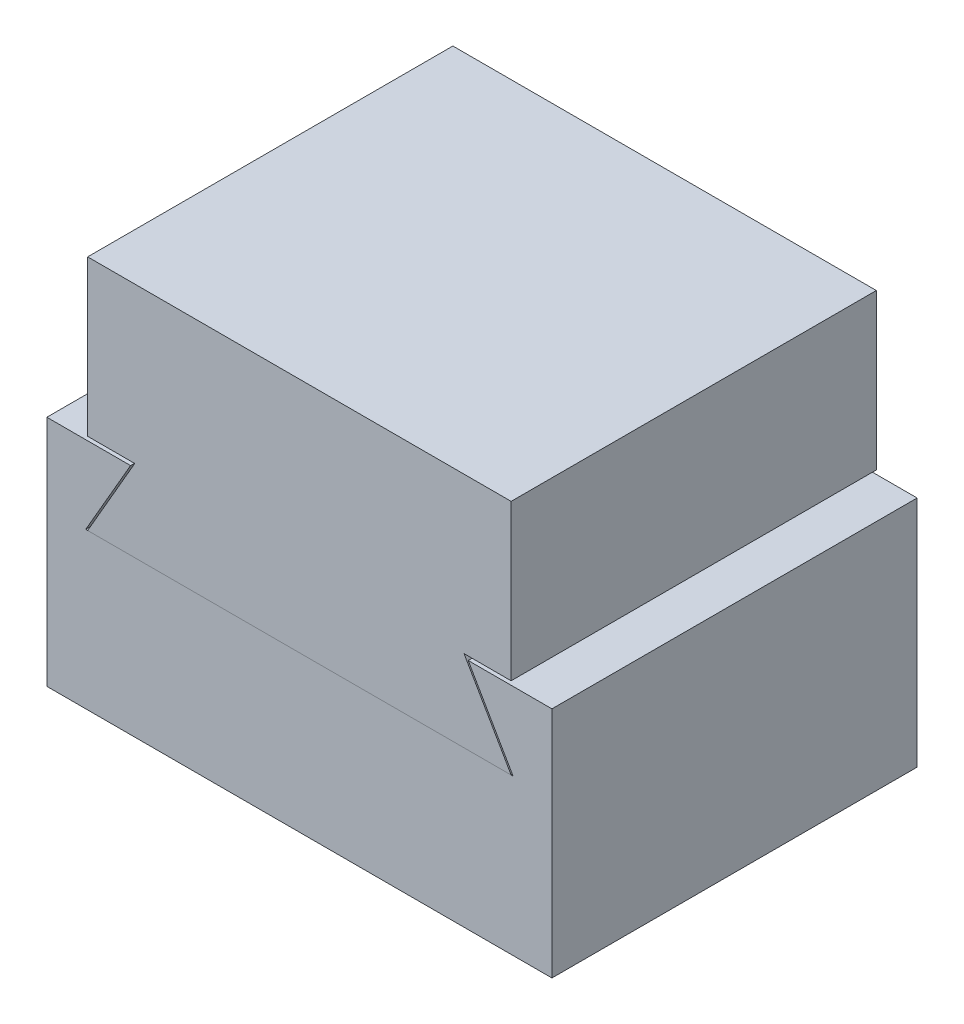
ISO-10303-21;
HEADER;
FILE_DESCRIPTION(('STEP AP214'),'2;1');
FILE_NAME('part.step','',(''),(''),'','','');
FILE_SCHEMA(('AUTOMOTIVE_DESIGN { 1 0 10303 214 1 1 1 1 }'));
ENDSEC;
DATA;
#1=APPLICATION_CONTEXT('core data for automotive mechanical design processes');
#2=APPLICATION_PROTOCOL_DEFINITION('international standard','automotive_design',2000,#1);
#3=PRODUCT_CONTEXT('',#1,'mechanical');
#4=PRODUCT('Part','Part','',(#3));
#5=PRODUCT_RELATED_PRODUCT_CATEGORY('part','',(#4));
#6=PRODUCT_DEFINITION_FORMATION('','',#4);
#7=PRODUCT_DEFINITION_CONTEXT('part definition',#1,'design');
#8=PRODUCT_DEFINITION('design','',#6,#7);
#9=PRODUCT_DEFINITION_SHAPE('','',#8);
#10=(LENGTH_UNIT() NAMED_UNIT(*) SI_UNIT(.MILLI.,.METRE.));
#11=(NAMED_UNIT(*) PLANE_ANGLE_UNIT() SI_UNIT($,.RADIAN.));
#12=(NAMED_UNIT(*) SI_UNIT($,.STERADIAN.) SOLID_ANGLE_UNIT());
#13=UNCERTAINTY_MEASURE_WITH_UNIT(LENGTH_MEASURE(1.E-05),#10,'distance_accuracy_value','');
#14=(GEOMETRIC_REPRESENTATION_CONTEXT(3) GLOBAL_UNCERTAINTY_ASSIGNED_CONTEXT((#13)) GLOBAL_UNIT_ASSIGNED_CONTEXT((#10,
#11,#12)) REPRESENTATION_CONTEXT('',''));
#15=CARTESIAN_POINT('',(0.,0.,0.));
#16=DIRECTION('',(0.,0.,1.));
#17=DIRECTION('',(1.,0.,0.));
#18=AXIS2_PLACEMENT_3D('',#15,#16,#17);
#19=CARTESIAN_POINT('',(-6.985,0.,11.938));
#20=DIRECTION('',(-0.866025403784439,0.5,0.));
#21=DIRECTION('',(-0.5,-0.866025403784439,0.));
#22=AXIS2_PLACEMENT_3D('',#19,#20,#21);
#23=PLANE('',#22);
#24=DIRECTION('',(0.5,0.866025403784439,0.));
#25=VECTOR('',#24,1.);
#26=CARTESIAN_POINT('',(-6.985,0.,0.));
#27=LINE('',#26,#25);
#28=CARTESIAN_POINT('',(-6.985,0.,0.));
#29=VERTEX_POINT('',#28);
#30=CARTESIAN_POINT('',(-5.51853031625835,2.54,0.));
#31=VERTEX_POINT('',#30);
#32=EDGE_CURVE('E142',#29,#31,#27,.T.);
#33=ORIENTED_EDGE('',*,*,#32,.T.);
#34=DIRECTION('',(0.,0.,-1.));
#35=VECTOR('',#34,1.);
#36=CARTESIAN_POINT('',(-5.51853031625835,2.54,11.938));
#37=LINE('',#36,#35);
#38=CARTESIAN_POINT('',(-5.51853031625835,2.54,11.938));
#39=VERTEX_POINT('',#38);
#40=EDGE_CURVE('E12',#39,#31,#37,.T.);
#41=ORIENTED_EDGE('',*,*,#40,.F.);
#42=DIRECTION('',(0.5,0.866025403784439,0.));
#43=VECTOR('',#42,1.);
#44=CARTESIAN_POINT('',(-6.985,0.,11.938));
#45=LINE('',#44,#43);
#46=CARTESIAN_POINT('',(-6.985,0.,11.938));
#47=VERTEX_POINT('',#46);
#48=EDGE_CURVE('E156',#47,#39,#45,.T.);
#49=ORIENTED_EDGE('',*,*,#48,.F.);
#50=DIRECTION('',(0.,0.,-1.));
#51=VECTOR('',#50,1.);
#52=CARTESIAN_POINT('',(-6.985,0.,11.938));
#53=LINE('',#52,#51);
#54=EDGE_CURVE('E138',#47,#29,#53,.T.);
#55=ORIENTED_EDGE('',*,*,#54,.T.);
#56=EDGE_LOOP('',(#33,#41,#49,#55));
#57=FACE_BOUND('',#56,.T.);
#58=ADVANCED_FACE('F46',(#57),#23,.F.);
#59=CARTESIAN_POINT('',(-8.255,2.54,11.938));
#60=DIRECTION('',(0.,-1.,0.));
#61=DIRECTION('',(0.,0.,-1.));
#62=AXIS2_PLACEMENT_3D('',#59,#60,#61);
#63=PLANE('',#62);
#64=DIRECTION('',(-1.,0.,0.));
#65=VECTOR('',#64,1.);
#66=CARTESIAN_POINT('',(-8.255,2.54,0.));
#67=LINE('',#66,#65);
#68=CARTESIAN_POINT('',(-8.255,2.54,0.));
#69=VERTEX_POINT('',#68);
#70=EDGE_CURVE('E145',#31,#69,#67,.T.);
#71=ORIENTED_EDGE('',*,*,#70,.T.);
#72=DIRECTION('',(0.,0.,-1.));
#73=VECTOR('',#72,1.);
#74=CARTESIAN_POINT('',(-8.255,2.54,11.938));
#75=LINE('',#74,#73);
#76=CARTESIAN_POINT('',(-8.255,2.54,11.938));
#77=VERTEX_POINT('',#76);
#78=EDGE_CURVE('E54',#77,#69,#75,.T.);
#79=ORIENTED_EDGE('',*,*,#78,.F.);
#80=DIRECTION('',(-1.,0.,0.));
#81=VECTOR('',#80,1.);
#82=CARTESIAN_POINT('',(-8.255,2.54,11.938));
#83=LINE('',#82,#81);
#84=EDGE_CURVE('E105',#39,#77,#83,.T.);
#85=ORIENTED_EDGE('',*,*,#84,.F.);
#86=ORIENTED_EDGE('',*,*,#40,.T.);
#87=EDGE_LOOP('',(#71,#79,#85,#86));
#88=FACE_BOUND('',#87,.T.);
#89=ADVANCED_FACE('F191',(#88),#63,.F.);
#90=CARTESIAN_POINT('',(-8.255,-5.08,11.938));
#91=DIRECTION('',(1.,0.,0.));
#92=DIRECTION('',(0.,0.,-1.));
#93=AXIS2_PLACEMENT_3D('',#90,#91,#92);
#94=PLANE('',#93);
#95=DIRECTION('',(0.,-1.,0.));
#96=VECTOR('',#95,1.);
#97=CARTESIAN_POINT('',(-8.255,-5.08,0.));
#98=LINE('',#97,#96);
#99=CARTESIAN_POINT('',(-8.255,-5.08,0.));
#100=VERTEX_POINT('',#99);
#101=EDGE_CURVE('E147',#69,#100,#98,.T.);
#102=ORIENTED_EDGE('',*,*,#101,.T.);
#103=DIRECTION('',(0.,0.,-1.));
#104=VECTOR('',#103,1.);
#105=CARTESIAN_POINT('',(-8.255,-5.08,11.938));
#106=LINE('',#105,#104);
#107=CARTESIAN_POINT('',(-8.255,-5.08,11.938));
#108=VERTEX_POINT('',#107);
#109=EDGE_CURVE('E163',#108,#100,#106,.T.);
#110=ORIENTED_EDGE('',*,*,#109,.F.);
#111=DIRECTION('',(0.,-1.,0.));
#112=VECTOR('',#111,1.);
#113=CARTESIAN_POINT('',(-8.255,-5.08,11.938));
#114=LINE('',#113,#112);
#115=EDGE_CURVE('E171',#77,#108,#114,.T.);
#116=ORIENTED_EDGE('',*,*,#115,.F.);
#117=ORIENTED_EDGE('',*,*,#78,.T.);
#118=EDGE_LOOP('',(#102,#110,#116,#117));
#119=FACE_BOUND('',#118,.T.);
#120=ADVANCED_FACE('F169',(#119),#94,.F.);
#121=CARTESIAN_POINT('',(8.255,-5.08,11.938));
#122=DIRECTION('',(0.,1.,0.));
#123=DIRECTION('',(-1.,0.,0.));
#124=AXIS2_PLACEMENT_3D('',#121,#122,#123);
#125=PLANE('',#124);
#126=DIRECTION('',(1.,0.,0.));
#127=VECTOR('',#126,1.);
#128=CARTESIAN_POINT('',(8.255,-5.08,0.));
#129=LINE('',#128,#127);
#130=CARTESIAN_POINT('',(8.255,-5.08,0.));
#131=VERTEX_POINT('',#130);
#132=EDGE_CURVE('E149',#100,#131,#129,.T.);
#133=ORIENTED_EDGE('',*,*,#132,.T.);
#134=DIRECTION('',(0.,0.,-1.));
#135=VECTOR('',#134,1.);
#136=CARTESIAN_POINT('',(8.255,-5.08,11.938));
#137=LINE('',#136,#135);
#138=CARTESIAN_POINT('',(8.255,-5.08,11.938));
#139=VERTEX_POINT('',#138);
#140=EDGE_CURVE('E160',#139,#131,#137,.T.);
#141=ORIENTED_EDGE('',*,*,#140,.F.);
#142=DIRECTION('',(1.,0.,0.));
#143=VECTOR('',#142,1.);
#144=CARTESIAN_POINT('',(8.255,-5.08,11.938));
#145=LINE('',#144,#143);
#146=EDGE_CURVE('E183',#108,#139,#145,.T.);
#147=ORIENTED_EDGE('',*,*,#146,.F.);
#148=ORIENTED_EDGE('',*,*,#109,.T.);
#149=EDGE_LOOP('',(#133,#141,#147,#148));
#150=FACE_BOUND('',#149,.T.);
#151=ADVANCED_FACE('F179',(#150),#125,.F.);
#152=CARTESIAN_POINT('',(8.255,2.54,11.938));
#153=DIRECTION('',(-1.,0.,0.));
#154=DIRECTION('',(0.,0.,1.));
#155=AXIS2_PLACEMENT_3D('',#152,#153,#154);
#156=PLANE('',#155);
#157=DIRECTION('',(0.,1.,0.));
#158=VECTOR('',#157,1.);
#159=CARTESIAN_POINT('',(8.255,2.54,0.));
#160=LINE('',#159,#158);
#161=CARTESIAN_POINT('',(8.255,2.54,0.));
#162=VERTEX_POINT('',#161);
#163=EDGE_CURVE('E151',#131,#162,#160,.T.);
#164=ORIENTED_EDGE('',*,*,#163,.T.);
#165=DIRECTION('',(0.,0.,-1.));
#166=VECTOR('',#165,1.);
#167=CARTESIAN_POINT('',(8.255,2.54,11.938));
#168=LINE('',#167,#166);
#169=CARTESIAN_POINT('',(8.255,2.54,11.938));
#170=VERTEX_POINT('',#169);
#171=EDGE_CURVE('E133',#170,#162,#168,.T.);
#172=ORIENTED_EDGE('',*,*,#171,.F.);
#173=DIRECTION('',(0.,1.,0.));
#174=VECTOR('',#173,1.);
#175=CARTESIAN_POINT('',(8.255,2.54,11.938));
#176=LINE('',#175,#174);
#177=EDGE_CURVE('E124',#139,#170,#176,.T.);
#178=ORIENTED_EDGE('',*,*,#177,.F.);
#179=ORIENTED_EDGE('',*,*,#140,.T.);
#180=EDGE_LOOP('',(#164,#172,#178,#179));
#181=FACE_BOUND('',#180,.T.);
#182=ADVANCED_FACE('F182',(#181),#156,.F.);
#183=CARTESIAN_POINT('',(5.51853031625835,2.54,11.938));
#184=DIRECTION('',(0.,-1.,0.));
#185=DIRECTION('',(0.,0.,-1.));
#186=AXIS2_PLACEMENT_3D('',#183,#184,#185);
#187=PLANE('',#186);
#188=DIRECTION('',(-1.,0.,0.));
#189=VECTOR('',#188,1.);
#190=CARTESIAN_POINT('',(5.51853031625835,2.54,0.));
#191=LINE('',#190,#189);
#192=CARTESIAN_POINT('',(5.51853031625835,2.54,0.));
#193=VERTEX_POINT('',#192);
#194=EDGE_CURVE('E132',#162,#193,#191,.T.);
#195=ORIENTED_EDGE('',*,*,#194,.T.);
#196=DIRECTION('',(0.,0.,-1.));
#197=VECTOR('',#196,1.);
#198=CARTESIAN_POINT('',(5.51853031625835,2.54,11.938));
#199=LINE('',#198,#197);
#200=CARTESIAN_POINT('',(5.51853031625835,2.54,11.938));
#201=VERTEX_POINT('',#200);
#202=EDGE_CURVE('E129',#201,#193,#199,.T.);
#203=ORIENTED_EDGE('',*,*,#202,.F.);
#204=DIRECTION('',(-1.,0.,0.));
#205=VECTOR('',#204,1.);
#206=CARTESIAN_POINT('',(5.51853031625835,2.54,11.938));
#207=LINE('',#206,#205);
#208=EDGE_CURVE('E118',#170,#201,#207,.T.);
#209=ORIENTED_EDGE('',*,*,#208,.F.);
#210=ORIENTED_EDGE('',*,*,#171,.T.);
#211=EDGE_LOOP('',(#195,#203,#209,#210));
#212=FACE_BOUND('',#211,.T.);
#213=ADVANCED_FACE('F130',(#212),#187,.F.);
#214=CARTESIAN_POINT('',(6.985,0.,11.938));
#215=DIRECTION('',(0.866025403784439,0.5,0.));
#216=DIRECTION('',(-0.5,0.866025403784438,0.));
#217=AXIS2_PLACEMENT_3D('',#214,#215,#216);
#218=PLANE('',#217);
#219=DIRECTION('',(0.5,-0.866025403784439,0.));
#220=VECTOR('',#219,1.);
#221=CARTESIAN_POINT('',(6.985,0.,0.));
#222=LINE('',#221,#220);
#223=CARTESIAN_POINT('',(6.985,0.,0.));
#224=VERTEX_POINT('',#223);
#225=EDGE_CURVE('E91',#193,#224,#222,.T.);
#226=ORIENTED_EDGE('',*,*,#225,.T.);
#227=DIRECTION('',(0.,0.,-1.));
#228=VECTOR('',#227,1.);
#229=CARTESIAN_POINT('',(6.985,0.,11.938));
#230=LINE('',#229,#228);
#231=CARTESIAN_POINT('',(6.985,0.,11.938));
#232=VERTEX_POINT('',#231);
#233=EDGE_CURVE('E134',#232,#224,#230,.T.);
#234=ORIENTED_EDGE('',*,*,#233,.F.);
#235=DIRECTION('',(0.5,-0.866025403784439,0.));
#236=VECTOR('',#235,1.);
#237=CARTESIAN_POINT('',(6.985,0.,11.938));
#238=LINE('',#237,#236);
#239=EDGE_CURVE('E122',#201,#232,#238,.T.);
#240=ORIENTED_EDGE('',*,*,#239,.F.);
#241=ORIENTED_EDGE('',*,*,#202,.T.);
#242=EDGE_LOOP('',(#226,#234,#240,#241));
#243=FACE_BOUND('',#242,.T.);
#244=ADVANCED_FACE('F136',(#243),#218,.F.);
#245=CARTESIAN_POINT('',(-6.985,0.,11.938));
#246=DIRECTION('',(0.,-1.,0.));
#247=DIRECTION('',(0.,0.,-1.));
#248=AXIS2_PLACEMENT_3D('',#245,#246,#247);
#249=PLANE('',#248);
#250=DIRECTION('',(-1.,0.,0.));
#251=VECTOR('',#250,1.);
#252=CARTESIAN_POINT('',(-6.985,0.,0.));
#253=LINE('',#252,#251);
#254=EDGE_CURVE('E97',#224,#29,#253,.T.);
#255=ORIENTED_EDGE('',*,*,#254,.T.);
#256=ORIENTED_EDGE('',*,*,#54,.F.);
#257=DIRECTION('',(-1.,0.,0.));
#258=VECTOR('',#257,1.);
#259=CARTESIAN_POINT('',(-6.985,0.,11.938));
#260=LINE('',#259,#258);
#261=EDGE_CURVE('E62',#232,#47,#260,.T.);
#262=ORIENTED_EDGE('',*,*,#261,.F.);
#263=ORIENTED_EDGE('',*,*,#233,.T.);
#264=EDGE_LOOP('',(#255,#256,#262,#263));
#265=FACE_BOUND('',#264,.T.);
#266=ADVANCED_FACE('F207',(#265),#249,.F.);
#267=CARTESIAN_POINT('',(-5.51853031625835,2.54,11.938));
#268=DIRECTION('',(0.,0.,-1.));
#269=DIRECTION('',(-1.,0.,0.));
#270=AXIS2_PLACEMENT_3D('',#267,#268,#269);
#271=PLANE('',#270);
#272=ORIENTED_EDGE('',*,*,#48,.T.);
#273=ORIENTED_EDGE('',*,*,#84,.T.);
#274=ORIENTED_EDGE('',*,*,#115,.T.);
#275=ORIENTED_EDGE('',*,*,#146,.T.);
#276=ORIENTED_EDGE('',*,*,#177,.T.);
#277=ORIENTED_EDGE('',*,*,#208,.T.);
#278=ORIENTED_EDGE('',*,*,#239,.T.);
#279=ORIENTED_EDGE('',*,*,#261,.T.);
#280=EDGE_LOOP('',(#272,#273,#274,#275,#276,#277,#278,#279));
#281=FACE_BOUND('',#280,.T.);
#282=ADVANCED_FACE('F120',(#281),#271,.F.);
#283=CARTESIAN_POINT('',(-5.51853031625835,2.54,0.));
#284=DIRECTION('',(0.,0.,-1.));
#285=DIRECTION('',(-1.,0.,0.));
#286=AXIS2_PLACEMENT_3D('',#283,#284,#285);
#287=PLANE('',#286);
#288=ORIENTED_EDGE('',*,*,#32,.F.);
#289=ORIENTED_EDGE('',*,*,#254,.F.);
#290=ORIENTED_EDGE('',*,*,#225,.F.);
#291=ORIENTED_EDGE('',*,*,#194,.F.);
#292=ORIENTED_EDGE('',*,*,#163,.F.);
#293=ORIENTED_EDGE('',*,*,#132,.F.);
#294=ORIENTED_EDGE('',*,*,#101,.F.);
#295=ORIENTED_EDGE('',*,*,#70,.F.);
#296=EDGE_LOOP('',(#288,#289,#290,#291,#292,#293,#294,#295));
#297=FACE_BOUND('',#296,.T.);
#298=ADVANCED_FACE('F175',(#297),#287,.T.);
#299=CLOSED_SHELL('',(#58,#89,#120,#151,#182,#213,#244,#266,#282,#298));
#300=MANIFOLD_SOLID_BREP('B2',#299);
#301=CARTESIAN_POINT('',(-6.9215,0.,11.938));
#302=DIRECTION('',(0.86602540378444,-0.499999999999998,0.));
#303=DIRECTION('',(0.499999999999998,0.86602540378444,0.));
#304=AXIS2_PLACEMENT_3D('',#301,#302,#303);
#305=PLANE('',#304);
#306=DIRECTION('',(-0.499999999999998,-0.86602540378444,0.));
#307=VECTOR('',#306,1.);
#308=CARTESIAN_POINT('',(-6.9215,0.,0.));
#309=LINE('',#308,#307);
#310=CARTESIAN_POINT('',(-5.38170683207128,2.667,0.));
#311=VERTEX_POINT('',#310);
#312=CARTESIAN_POINT('',(-6.9215,0.,0.));
#313=VERTEX_POINT('',#312);
#314=EDGE_CURVE('E369',#311,#313,#309,.T.);
#315=ORIENTED_EDGE('',*,*,#314,.T.);
#316=DIRECTION('',(0.,0.,-1.));
#317=VECTOR('',#316,1.);
#318=CARTESIAN_POINT('',(-6.9215,0.,11.938));
#319=LINE('',#318,#317);
#320=CARTESIAN_POINT('',(-6.9215,0.,11.938));
#321=VERTEX_POINT('',#320);
#322=EDGE_CURVE('E44',#321,#313,#319,.T.);
#323=ORIENTED_EDGE('',*,*,#322,.F.);
#324=DIRECTION('',(-0.499999999999998,-0.86602540378444,0.));
#325=VECTOR('',#324,1.);
#326=CARTESIAN_POINT('',(-6.9215,0.,11.938));
#327=LINE('',#326,#325);
#328=CARTESIAN_POINT('',(-5.38170683207128,2.667,11.938));
#329=VERTEX_POINT('',#328);
#330=EDGE_CURVE('E383',#329,#321,#327,.T.);
#331=ORIENTED_EDGE('',*,*,#330,.F.);
#332=DIRECTION('',(0.,0.,-1.));
#333=VECTOR('',#332,1.);
#334=CARTESIAN_POINT('',(-5.38170683207128,2.667,11.938));
#335=LINE('',#334,#333);
#336=EDGE_CURVE('E365',#329,#311,#335,.T.);
#337=ORIENTED_EDGE('',*,*,#336,.T.);
#338=EDGE_LOOP('',(#315,#323,#331,#337));
#339=FACE_BOUND('',#338,.T.);
#340=ADVANCED_FACE('F273',(#339),#305,.F.);
#341=CARTESIAN_POINT('',(-6.9215,0.,11.938));
#342=DIRECTION('',(0.,1.,0.));
#343=DIRECTION('',(0.,0.,1.));
#344=AXIS2_PLACEMENT_3D('',#341,#342,#343);
#345=PLANE('',#344);
#346=DIRECTION('',(1.,0.,0.));
#347=VECTOR('',#346,1.);
#348=CARTESIAN_POINT('',(-6.9215,0.,0.));
#349=LINE('',#348,#347);
#350=CARTESIAN_POINT('',(6.9215,0.,0.));
#351=VERTEX_POINT('',#350);
#352=EDGE_CURVE('E372',#313,#351,#349,.T.);
#353=ORIENTED_EDGE('',*,*,#352,.T.);
#354=DIRECTION('',(0.,0.,-1.));
#355=VECTOR('',#354,1.);
#356=CARTESIAN_POINT('',(6.9215,0.,11.938));
#357=LINE('',#356,#355);
#358=CARTESIAN_POINT('',(6.9215,0.,11.938));
#359=VERTEX_POINT('',#358);
#360=EDGE_CURVE('E281',#359,#351,#357,.T.);
#361=ORIENTED_EDGE('',*,*,#360,.F.);
#362=DIRECTION('',(1.,0.,0.));
#363=VECTOR('',#362,1.);
#364=CARTESIAN_POINT('',(-6.9215,0.,11.938));
#365=LINE('',#364,#363);
#366=EDGE_CURVE('E332',#321,#359,#365,.T.);
#367=ORIENTED_EDGE('',*,*,#366,.F.);
#368=ORIENTED_EDGE('',*,*,#322,.T.);
#369=EDGE_LOOP('',(#353,#361,#367,#368));
#370=FACE_BOUND('',#369,.T.);
#371=ADVANCED_FACE('F418',(#370),#345,.F.);
#372=CARTESIAN_POINT('',(6.9215,0.,11.938));
#373=DIRECTION('',(-0.866025403784436,-0.500000000000004,0.));
#374=DIRECTION('',(0.500000000000004,-0.866025403784436,0.));
#375=AXIS2_PLACEMENT_3D('',#372,#373,#374);
#376=PLANE('',#375);
#377=DIRECTION('',(-0.500000000000004,0.866025403784436,0.));
#378=VECTOR('',#377,1.);
#379=CARTESIAN_POINT('',(6.9215,0.,0.));
#380=LINE('',#379,#378);
#381=CARTESIAN_POINT('',(5.38170683207125,2.667,0.));
#382=VERTEX_POINT('',#381);
#383=EDGE_CURVE('E374',#351,#382,#380,.T.);
#384=ORIENTED_EDGE('',*,*,#383,.T.);
#385=DIRECTION('',(0.,0.,-1.));
#386=VECTOR('',#385,1.);
#387=CARTESIAN_POINT('',(5.38170683207125,2.667,11.938));
#388=LINE('',#387,#386);
#389=CARTESIAN_POINT('',(5.38170683207125,2.667,11.938));
#390=VERTEX_POINT('',#389);
#391=EDGE_CURVE('E390',#390,#382,#388,.T.);
#392=ORIENTED_EDGE('',*,*,#391,.F.);
#393=DIRECTION('',(-0.500000000000004,0.866025403784436,0.));
#394=VECTOR('',#393,1.);
#395=CARTESIAN_POINT('',(6.9215,0.,11.938));
#396=LINE('',#395,#394);
#397=EDGE_CURVE('E398',#359,#390,#396,.T.);
#398=ORIENTED_EDGE('',*,*,#397,.F.);
#399=ORIENTED_EDGE('',*,*,#360,.T.);
#400=EDGE_LOOP('',(#384,#392,#398,#399));
#401=FACE_BOUND('',#400,.T.);
#402=ADVANCED_FACE('F396',(#401),#376,.F.);
#403=CARTESIAN_POINT('',(5.38170683207125,2.667,11.938));
#404=DIRECTION('',(0.,1.,0.));
#405=DIRECTION('',(0.,0.,1.));
#406=AXIS2_PLACEMENT_3D('',#403,#404,#405);
#407=PLANE('',#406);
#408=DIRECTION('',(1.,0.,0.));
#409=VECTOR('',#408,1.);
#410=CARTESIAN_POINT('',(5.38170683207125,2.667,0.));
#411=LINE('',#410,#409);
#412=CARTESIAN_POINT('',(6.9215,2.667,0.));
#413=VERTEX_POINT('',#412);
#414=EDGE_CURVE('E376',#382,#413,#411,.T.);
#415=ORIENTED_EDGE('',*,*,#414,.T.);
#416=DIRECTION('',(0.,0.,-1.));
#417=VECTOR('',#416,1.);
#418=CARTESIAN_POINT('',(6.9215,2.667,11.938));
#419=LINE('',#418,#417);
#420=CARTESIAN_POINT('',(6.9215,2.667,11.938));
#421=VERTEX_POINT('',#420);
#422=EDGE_CURVE('E387',#421,#413,#419,.T.);
#423=ORIENTED_EDGE('',*,*,#422,.F.);
#424=DIRECTION('',(1.,0.,0.));
#425=VECTOR('',#424,1.);
#426=CARTESIAN_POINT('',(5.38170683207125,2.667,11.938));
#427=LINE('',#426,#425);
#428=EDGE_CURVE('E410',#390,#421,#427,.T.);
#429=ORIENTED_EDGE('',*,*,#428,.F.);
#430=ORIENTED_EDGE('',*,*,#391,.T.);
#431=EDGE_LOOP('',(#415,#423,#429,#430));
#432=FACE_BOUND('',#431,.T.);
#433=ADVANCED_FACE('F406',(#432),#407,.F.);
#434=CARTESIAN_POINT('',(6.9215,7.747,11.938));
#435=DIRECTION('',(-1.,0.,0.));
#436=DIRECTION('',(0.,-1.,0.));
#437=AXIS2_PLACEMENT_3D('',#434,#435,#436);
#438=PLANE('',#437);
#439=DIRECTION('',(0.,1.,0.));
#440=VECTOR('',#439,1.);
#441=CARTESIAN_POINT('',(6.9215,7.747,0.));
#442=LINE('',#441,#440);
#443=CARTESIAN_POINT('',(6.9215,7.747,0.));
#444=VERTEX_POINT('',#443);
#445=EDGE_CURVE('E378',#413,#444,#442,.T.);
#446=ORIENTED_EDGE('',*,*,#445,.T.);
#447=DIRECTION('',(0.,0.,-1.));
#448=VECTOR('',#447,1.);
#449=CARTESIAN_POINT('',(6.9215,7.747,11.938));
#450=LINE('',#449,#448);
#451=CARTESIAN_POINT('',(6.9215,7.747,11.938));
#452=VERTEX_POINT('',#451);
#453=EDGE_CURVE('E360',#452,#444,#450,.T.);
#454=ORIENTED_EDGE('',*,*,#453,.F.);
#455=DIRECTION('',(0.,1.,0.));
#456=VECTOR('',#455,1.);
#457=CARTESIAN_POINT('',(6.9215,7.747,11.938));
#458=LINE('',#457,#456);
#459=EDGE_CURVE('E351',#421,#452,#458,.T.);
#460=ORIENTED_EDGE('',*,*,#459,.F.);
#461=ORIENTED_EDGE('',*,*,#422,.T.);
#462=EDGE_LOOP('',(#446,#454,#460,#461));
#463=FACE_BOUND('',#462,.T.);
#464=ADVANCED_FACE('F409',(#463),#438,.F.);
#465=CARTESIAN_POINT('',(-6.9215,7.747,11.938));
#466=DIRECTION('',(0.,-1.,0.));
#467=DIRECTION('',(0.,0.,-1.));
#468=AXIS2_PLACEMENT_3D('',#465,#466,#467);
#469=PLANE('',#468);
#470=DIRECTION('',(-1.,0.,0.));
#471=VECTOR('',#470,1.);
#472=CARTESIAN_POINT('',(-6.9215,7.747,0.));
#473=LINE('',#472,#471);
#474=CARTESIAN_POINT('',(-6.9215,7.747,0.));
#475=VERTEX_POINT('',#474);
#476=EDGE_CURVE('E359',#444,#475,#473,.T.);
#477=ORIENTED_EDGE('',*,*,#476,.T.);
#478=DIRECTION('',(0.,0.,-1.));
#479=VECTOR('',#478,1.);
#480=CARTESIAN_POINT('',(-6.9215,7.747,11.938));
#481=LINE('',#480,#479);
#482=CARTESIAN_POINT('',(-6.9215,7.747,11.938));
#483=VERTEX_POINT('',#482);
#484=EDGE_CURVE('E356',#483,#475,#481,.T.);
#485=ORIENTED_EDGE('',*,*,#484,.F.);
#486=DIRECTION('',(-1.,0.,0.));
#487=VECTOR('',#486,1.);
#488=CARTESIAN_POINT('',(-6.9215,7.747,11.938));
#489=LINE('',#488,#487);
#490=EDGE_CURVE('E345',#452,#483,#489,.T.);
#491=ORIENTED_EDGE('',*,*,#490,.F.);
#492=ORIENTED_EDGE('',*,*,#453,.T.);
#493=EDGE_LOOP('',(#477,#485,#491,#492));
#494=FACE_BOUND('',#493,.T.);
#495=ADVANCED_FACE('F357',(#494),#469,.F.);
#496=CARTESIAN_POINT('',(-6.9215,2.667,11.938));
#497=DIRECTION('',(1.,0.,0.));
#498=DIRECTION('',(0.,1.,0.));
#499=AXIS2_PLACEMENT_3D('',#496,#497,#498);
#500=PLANE('',#499);
#501=DIRECTION('',(0.,-1.,0.));
#502=VECTOR('',#501,1.);
#503=CARTESIAN_POINT('',(-6.9215,2.667,0.));
#504=LINE('',#503,#502);
#505=CARTESIAN_POINT('',(-6.9215,2.667,0.));
#506=VERTEX_POINT('',#505);
#507=EDGE_CURVE('E318',#475,#506,#504,.T.);
#508=ORIENTED_EDGE('',*,*,#507,.T.);
#509=DIRECTION('',(0.,0.,-1.));
#510=VECTOR('',#509,1.);
#511=CARTESIAN_POINT('',(-6.9215,2.667,11.938));
#512=LINE('',#511,#510);
#513=CARTESIAN_POINT('',(-6.9215,2.667,11.938));
#514=VERTEX_POINT('',#513);
#515=EDGE_CURVE('E361',#514,#506,#512,.T.);
#516=ORIENTED_EDGE('',*,*,#515,.F.);
#517=DIRECTION('',(0.,-1.,0.));
#518=VECTOR('',#517,1.);
#519=CARTESIAN_POINT('',(-6.9215,2.667,11.938));
#520=LINE('',#519,#518);
#521=EDGE_CURVE('E349',#483,#514,#520,.T.);
#522=ORIENTED_EDGE('',*,*,#521,.F.);
#523=ORIENTED_EDGE('',*,*,#484,.T.);
#524=EDGE_LOOP('',(#508,#516,#522,#523));
#525=FACE_BOUND('',#524,.T.);
#526=ADVANCED_FACE('F363',(#525),#500,.F.);
#527=CARTESIAN_POINT('',(-5.38170683207128,2.667,11.938));
#528=DIRECTION('',(0.,1.,0.));
#529=DIRECTION('',(0.,0.,1.));
#530=AXIS2_PLACEMENT_3D('',#527,#528,#529);
#531=PLANE('',#530);
#532=DIRECTION('',(1.,0.,0.));
#533=VECTOR('',#532,1.);
#534=CARTESIAN_POINT('',(-5.38170683207128,2.667,0.));
#535=LINE('',#534,#533);
#536=EDGE_CURVE('E324',#506,#311,#535,.T.);
#537=ORIENTED_EDGE('',*,*,#536,.T.);
#538=ORIENTED_EDGE('',*,*,#336,.F.);
#539=DIRECTION('',(1.,0.,0.));
#540=VECTOR('',#539,1.);
#541=CARTESIAN_POINT('',(-5.38170683207128,2.667,11.938));
#542=LINE('',#541,#540);
#543=EDGE_CURVE('E289',#514,#329,#542,.T.);
#544=ORIENTED_EDGE('',*,*,#543,.F.);
#545=ORIENTED_EDGE('',*,*,#515,.T.);
#546=EDGE_LOOP('',(#537,#538,#544,#545));
#547=FACE_BOUND('',#546,.T.);
#548=ADVANCED_FACE('F434',(#547),#531,.F.);
#549=CARTESIAN_POINT('',(-5.38170683207128,2.667,11.938));
#550=DIRECTION('',(0.,0.,1.));
#551=DIRECTION('',(1.,0.,0.));
#552=AXIS2_PLACEMENT_3D('',#549,#550,#551);
#553=PLANE('',#552);
#554=ORIENTED_EDGE('',*,*,#330,.T.);
#555=ORIENTED_EDGE('',*,*,#366,.T.);
#556=ORIENTED_EDGE('',*,*,#397,.T.);
#557=ORIENTED_EDGE('',*,*,#428,.T.);
#558=ORIENTED_EDGE('',*,*,#459,.T.);
#559=ORIENTED_EDGE('',*,*,#490,.T.);
#560=ORIENTED_EDGE('',*,*,#521,.T.);
#561=ORIENTED_EDGE('',*,*,#543,.T.);
#562=EDGE_LOOP('',(#554,#555,#556,#557,#558,#559,#560,#561));
#563=FACE_BOUND('',#562,.T.);
#564=ADVANCED_FACE('F347',(#563),#553,.T.);
#565=CARTESIAN_POINT('',(-5.38170683207128,2.667,0.));
#566=DIRECTION('',(0.,0.,1.));
#567=DIRECTION('',(1.,0.,0.));
#568=AXIS2_PLACEMENT_3D('',#565,#566,#567);
#569=PLANE('',#568);
#570=ORIENTED_EDGE('',*,*,#314,.F.);
#571=ORIENTED_EDGE('',*,*,#536,.F.);
#572=ORIENTED_EDGE('',*,*,#507,.F.);
#573=ORIENTED_EDGE('',*,*,#476,.F.);
#574=ORIENTED_EDGE('',*,*,#445,.F.);
#575=ORIENTED_EDGE('',*,*,#414,.F.);
#576=ORIENTED_EDGE('',*,*,#383,.F.);
#577=ORIENTED_EDGE('',*,*,#352,.F.);
#578=EDGE_LOOP('',(#570,#571,#572,#573,#574,#575,#576,#577));
#579=FACE_BOUND('',#578,.T.);
#580=ADVANCED_FACE('F402',(#579),#569,.F.);
#581=CLOSED_SHELL('',(#340,#371,#402,#433,#464,#495,#526,#548,#564,#580));
#582=MANIFOLD_SOLID_BREP('B6',#581);
#583=ADVANCED_BREP_SHAPE_REPRESENTATION('',(#18,#300,#582),#14);
#584=SHAPE_DEFINITION_REPRESENTATION(#9,#583);
ENDSEC;
END-ISO-10303-21;
